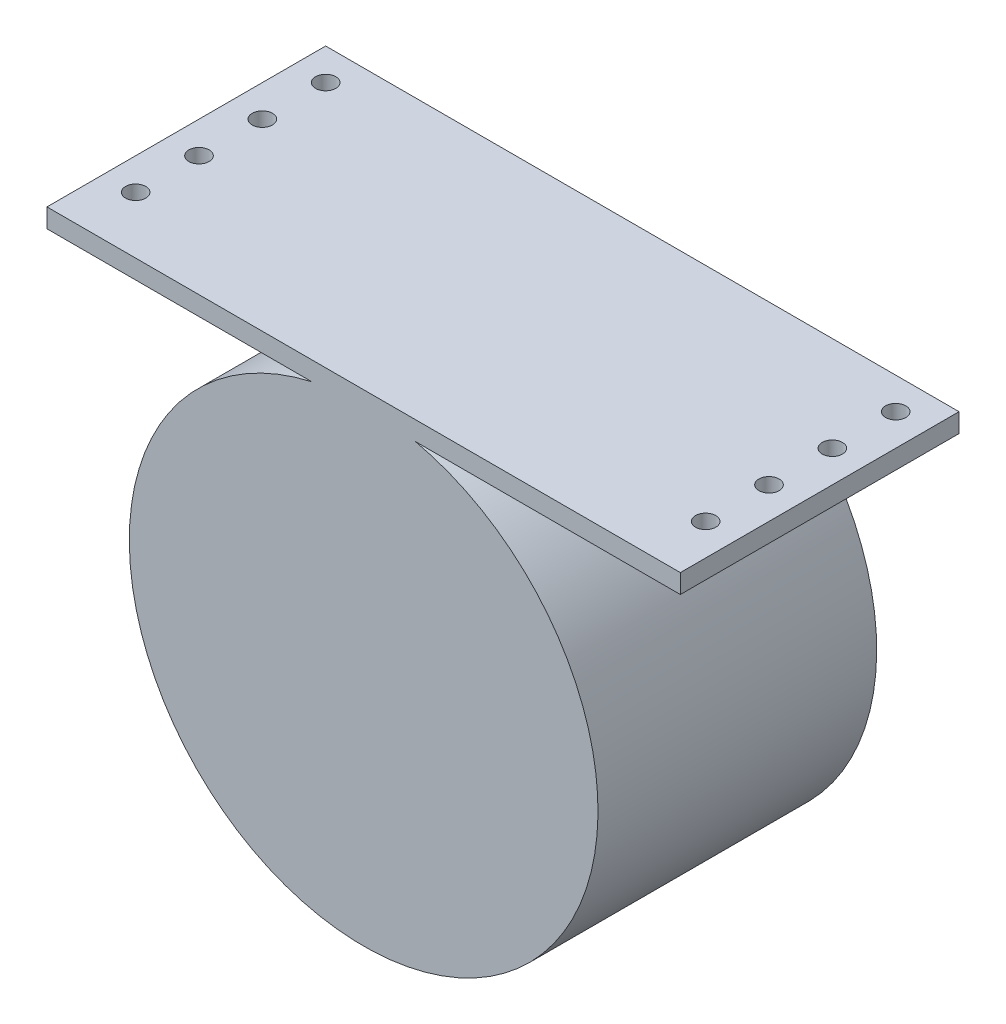
ISO-10303-21;
HEADER;
FILE_DESCRIPTION(('STEP AP214'),'2;1');
FILE_NAME('part.step','',(''),(''),'','','');
FILE_SCHEMA(('AUTOMOTIVE_DESIGN { 1 0 10303 214 1 1 1 1 }'));
ENDSEC;
DATA;
#1=APPLICATION_CONTEXT('core data for automotive mechanical design processes');
#2=APPLICATION_PROTOCOL_DEFINITION('international standard','automotive_design',2000,#1);
#3=PRODUCT_CONTEXT('',#1,'mechanical');
#4=PRODUCT('Part','Part','',(#3));
#5=PRODUCT_RELATED_PRODUCT_CATEGORY('part','',(#4));
#6=PRODUCT_DEFINITION_FORMATION('','',#4);
#7=PRODUCT_DEFINITION_CONTEXT('part definition',#1,'design');
#8=PRODUCT_DEFINITION('design','',#6,#7);
#9=PRODUCT_DEFINITION_SHAPE('','',#8);
#10=(LENGTH_UNIT() NAMED_UNIT(*) SI_UNIT(.MILLI.,.METRE.));
#11=(NAMED_UNIT(*) PLANE_ANGLE_UNIT() SI_UNIT($,.RADIAN.));
#12=(NAMED_UNIT(*) SI_UNIT($,.STERADIAN.) SOLID_ANGLE_UNIT());
#13=UNCERTAINTY_MEASURE_WITH_UNIT(LENGTH_MEASURE(1.E-05),#10,'distance_accuracy_value','');
#14=(GEOMETRIC_REPRESENTATION_CONTEXT(3) GLOBAL_UNCERTAINTY_ASSIGNED_CONTEXT((#13)) GLOBAL_UNIT_ASSIGNED_CONTEXT((#10,
#11,#12)) REPRESENTATION_CONTEXT('',''));
#15=CARTESIAN_POINT('',(0.,0.,0.));
#16=DIRECTION('',(0.,0.,1.));
#17=DIRECTION('',(1.,0.,0.));
#18=AXIS2_PLACEMENT_3D('',#15,#16,#17);
#19=CARTESIAN_POINT('',(-5.79533911298797,4.18541454246696,0.));
#20=DIRECTION('',(0.,0.,1.));
#21=DIRECTION('',(1.,0.,0.));
#22=AXIS2_PLACEMENT_3D('',#19,#20,#21);
#23=PLANE('',#22);
#24=CARTESIAN_POINT('',(-5.79533911298797,4.18541454246696,0.));
#25=DIRECTION('',(0.,0.,-1.));
#26=DIRECTION('',(-1.,0.,0.));
#27=AXIS2_PLACEMENT_3D('',#24,#25,#26);
#28=CIRCLE('',#27,34.);
#29=CARTESIAN_POINT('',(-39.795339112988,4.18541454246696,0.));
#30=VERTEX_POINT('',#29);
#31=EDGE_CURVE('E152',#30,#30,#28,.T.);
#32=ORIENTED_EDGE('',*,*,#31,.F.);
#33=EDGE_LOOP('',(#32));
#34=FACE_BOUND('',#33,.T.);
#35=CARTESIAN_POINT('',(-5.79533911298797,4.18541454246696,0.));
#36=DIRECTION('',(0.,0.,1.));
#37=DIRECTION('',(1.,0.,0.));
#38=AXIS2_PLACEMENT_3D('',#35,#36,#37);
#39=CIRCLE('',#38,37.);
#40=CARTESIAN_POINT('',(-13.9678124205024,40.2715708913768,0.));
#41=VERTEX_POINT('',#40);
#42=CARTESIAN_POINT('',(2.37713419452647,40.2715708913768,0.));
#43=VERTEX_POINT('',#42);
#44=EDGE_CURVE('E110',#41,#43,#39,.T.);
#45=ORIENTED_EDGE('',*,*,#44,.F.);
#46=DIRECTION('',(1.,0.,0.));
#47=VECTOR('',#46,1.);
#48=CARTESIAN_POINT('',(-55.795339112988,40.2715708913768,0.));
#49=LINE('',#48,#47);
#50=CARTESIAN_POINT('',(-55.795339112988,40.2715708913768,0.));
#51=VERTEX_POINT('',#50);
#52=EDGE_CURVE('E123',#51,#41,#49,.T.);
#53=ORIENTED_EDGE('',*,*,#52,.F.);
#54=DIRECTION('',(0.,1.,0.));
#55=VECTOR('',#54,1.);
#56=CARTESIAN_POINT('',(-55.795339112988,40.2715708913768,0.));
#57=LINE('',#56,#55);
#58=CARTESIAN_POINT('',(-55.795339112988,43.2715708913768,0.));
#59=VERTEX_POINT('',#58);
#60=EDGE_CURVE('E104',#51,#59,#57,.T.);
#61=ORIENTED_EDGE('',*,*,#60,.T.);
#62=DIRECTION('',(1.,0.,0.));
#63=VECTOR('',#62,1.);
#64=CARTESIAN_POINT('',(-55.795339112988,43.2715708913768,0.));
#65=LINE('',#64,#63);
#66=CARTESIAN_POINT('',(44.204660887012,43.2715708913768,0.));
#67=VERTEX_POINT('',#66);
#68=EDGE_CURVE('E113',#59,#67,#65,.T.);
#69=ORIENTED_EDGE('',*,*,#68,.T.);
#70=DIRECTION('',(0.,1.,0.));
#71=VECTOR('',#70,1.);
#72=CARTESIAN_POINT('',(44.204660887012,40.2715708913768,0.));
#73=LINE('',#72,#71);
#74=CARTESIAN_POINT('',(44.204660887012,40.2715708913768,0.));
#75=VERTEX_POINT('',#74);
#76=EDGE_CURVE('E119',#75,#67,#73,.T.);
#77=ORIENTED_EDGE('',*,*,#76,.F.);
#78=EDGE_CURVE('E128',#43,#75,#49,.T.);
#79=ORIENTED_EDGE('',*,*,#78,.F.);
#80=EDGE_LOOP('',(#45,#53,#61,#69,#77,#79));
#81=FACE_BOUND('',#80,.T.);
#82=ADVANCED_FACE('F49',(#34,#81),#23,.F.);
#83=CARTESIAN_POINT('',(-5.79533911298797,4.18541454246696,44.));
#84=DIRECTION('',(0.,0.,1.));
#85=DIRECTION('',(1.,0.,0.));
#86=AXIS2_PLACEMENT_3D('',#83,#84,#85);
#87=PLANE('',#86);
#88=CARTESIAN_POINT('',(-5.79533911298797,4.18541454246696,44.));
#89=DIRECTION('',(0.,0.,1.));
#90=DIRECTION('',(1.,0.,0.));
#91=AXIS2_PLACEMENT_3D('',#88,#89,#90);
#92=CIRCLE('',#91,37.);
#93=CARTESIAN_POINT('',(-13.9678124205024,40.2715708913768,44.));
#94=VERTEX_POINT('',#93);
#95=CARTESIAN_POINT('',(2.37713419452647,40.2715708913768,44.));
#96=VERTEX_POINT('',#95);
#97=EDGE_CURVE('E137',#94,#96,#92,.T.);
#98=ORIENTED_EDGE('',*,*,#97,.T.);
#99=DIRECTION('',(1.,0.,0.));
#100=VECTOR('',#99,1.);
#101=CARTESIAN_POINT('',(-55.795339112988,40.2715708913768,44.));
#102=LINE('',#101,#100);
#103=CARTESIAN_POINT('',(44.204660887012,40.2715708913768,44.));
#104=VERTEX_POINT('',#103);
#105=EDGE_CURVE('E186',#96,#104,#102,.T.);
#106=ORIENTED_EDGE('',*,*,#105,.T.);
#107=DIRECTION('',(0.,1.,0.));
#108=VECTOR('',#107,1.);
#109=CARTESIAN_POINT('',(44.204660887012,40.2715708913768,44.));
#110=LINE('',#109,#108);
#111=CARTESIAN_POINT('',(44.204660887012,43.2715708913768,44.));
#112=VERTEX_POINT('',#111);
#113=EDGE_CURVE('E126',#104,#112,#110,.T.);
#114=ORIENTED_EDGE('',*,*,#113,.T.);
#115=DIRECTION('',(1.,0.,0.));
#116=VECTOR('',#115,1.);
#117=CARTESIAN_POINT('',(-55.795339112988,43.2715708913768,44.));
#118=LINE('',#117,#116);
#119=CARTESIAN_POINT('',(-55.795339112988,43.2715708913768,44.));
#120=VERTEX_POINT('',#119);
#121=EDGE_CURVE('E124',#120,#112,#118,.T.);
#122=ORIENTED_EDGE('',*,*,#121,.F.);
#123=DIRECTION('',(0.,1.,0.));
#124=VECTOR('',#123,1.);
#125=CARTESIAN_POINT('',(-55.795339112988,40.2715708913768,44.));
#126=LINE('',#125,#124);
#127=CARTESIAN_POINT('',(-55.795339112988,40.2715708913768,44.));
#128=VERTEX_POINT('',#127);
#129=EDGE_CURVE('E106',#128,#120,#126,.T.);
#130=ORIENTED_EDGE('',*,*,#129,.F.);
#131=EDGE_CURVE('E187',#128,#94,#102,.T.);
#132=ORIENTED_EDGE('',*,*,#131,.T.);
#133=EDGE_LOOP('',(#98,#106,#114,#122,#130,#132));
#134=FACE_BOUND('',#133,.T.);
#135=ADVANCED_FACE('F198',(#134),#87,.T.);
#136=CARTESIAN_POINT('',(-5.79533911298797,4.18541454246696,44.));
#137=DIRECTION('',(0.,0.,-1.));
#138=DIRECTION('',(-1.,0.,0.));
#139=AXIS2_PLACEMENT_3D('',#136,#137,#138);
#140=CYLINDRICAL_SURFACE('',#139,37.);
#141=DIRECTION('',(0.,0.,-1.));
#142=VECTOR('',#141,1.);
#143=CARTESIAN_POINT('',(2.37713419452647,40.2715708913768,44.));
#144=LINE('',#143,#142);
#145=EDGE_CURVE('E12',#96,#43,#144,.T.);
#146=ORIENTED_EDGE('',*,*,#145,.F.);
#147=ORIENTED_EDGE('',*,*,#97,.F.);
#148=DIRECTION('',(0.,0.,-1.));
#149=VECTOR('',#148,1.);
#150=CARTESIAN_POINT('',(-13.9678124205024,40.2715708913768,44.));
#151=LINE('',#150,#149);
#152=EDGE_CURVE('E59',#41,#94,#151,.F.);
#153=ORIENTED_EDGE('',*,*,#152,.F.);
#154=ORIENTED_EDGE('',*,*,#44,.T.);
#155=EDGE_LOOP('',(#146,#147,#153,#154));
#156=FACE_BOUND('',#155,.T.);
#157=ADVANCED_FACE('F201',(#156),#140,.T.);
#158=CARTESIAN_POINT('',(44.204660887012,40.2715708913768,44.));
#159=DIRECTION('',(-1.,0.,0.));
#160=DIRECTION('',(0.,0.,1.));
#161=AXIS2_PLACEMENT_3D('',#158,#159,#160);
#162=PLANE('',#161);
#163=ORIENTED_EDGE('',*,*,#76,.T.);
#164=DIRECTION('',(0.,0.,-1.));
#165=VECTOR('',#164,1.);
#166=CARTESIAN_POINT('',(44.204660887012,43.2715708913768,44.));
#167=LINE('',#166,#165);
#168=EDGE_CURVE('E115',#112,#67,#167,.T.);
#169=ORIENTED_EDGE('',*,*,#168,.F.);
#170=ORIENTED_EDGE('',*,*,#113,.F.);
#171=DIRECTION('',(0.,0.,-1.));
#172=VECTOR('',#171,1.);
#173=CARTESIAN_POINT('',(44.204660887012,40.2715708913768,44.));
#174=LINE('',#173,#172);
#175=EDGE_CURVE('E133',#104,#75,#174,.T.);
#176=ORIENTED_EDGE('',*,*,#175,.T.);
#177=EDGE_LOOP('',(#163,#169,#170,#176));
#178=FACE_BOUND('',#177,.T.);
#179=ADVANCED_FACE('F196',(#178),#162,.F.);
#180=CARTESIAN_POINT('',(-55.795339112988,43.2715708913768,44.));
#181=DIRECTION('',(0.,1.,0.));
#182=DIRECTION('',(0.,0.,1.));
#183=AXIS2_PLACEMENT_3D('',#180,#181,#182);
#184=PLANE('',#183);
#185=CARTESIAN_POINT('',(39.204660887012,43.2715708913768,5.));
#186=DIRECTION('',(0.,1.,0.));
#187=DIRECTION('',(0.,0.,1.));
#188=AXIS2_PLACEMENT_3D('',#185,#186,#187);
#189=CIRCLE('',#188,1.6);
#190=CARTESIAN_POINT('',(39.204660887012,43.2715708913768,6.6));
#191=VERTEX_POINT('',#190);
#192=EDGE_CURVE('E157',#191,#191,#189,.T.);
#193=ORIENTED_EDGE('',*,*,#192,.F.);
#194=EDGE_LOOP('',(#193));
#195=FACE_BOUND('',#194,.T.);
#196=CARTESIAN_POINT('',(39.204660887012,43.2715708913768,15.));
#197=DIRECTION('',(0.,1.,0.));
#198=DIRECTION('',(0.,0.,1.));
#199=AXIS2_PLACEMENT_3D('',#196,#197,#198);
#200=CIRCLE('',#199,1.6);
#201=CARTESIAN_POINT('',(39.204660887012,43.2715708913768,16.6));
#202=VERTEX_POINT('',#201);
#203=EDGE_CURVE('E278',#202,#202,#200,.T.);
#204=ORIENTED_EDGE('',*,*,#203,.F.);
#205=EDGE_LOOP('',(#204));
#206=FACE_BOUND('',#205,.T.);
#207=CARTESIAN_POINT('',(39.204660887012,43.2715708913768,25.));
#208=DIRECTION('',(0.,1.,0.));
#209=DIRECTION('',(0.,0.,1.));
#210=AXIS2_PLACEMENT_3D('',#207,#208,#209);
#211=CIRCLE('',#210,1.6);
#212=CARTESIAN_POINT('',(39.204660887012,43.2715708913768,26.6));
#213=VERTEX_POINT('',#212);
#214=EDGE_CURVE('E281',#213,#213,#211,.T.);
#215=ORIENTED_EDGE('',*,*,#214,.F.);
#216=EDGE_LOOP('',(#215));
#217=FACE_BOUND('',#216,.T.);
#218=CARTESIAN_POINT('',(39.204660887012,43.2715708913768,35.));
#219=DIRECTION('',(0.,1.,0.));
#220=DIRECTION('',(0.,0.,1.));
#221=AXIS2_PLACEMENT_3D('',#218,#219,#220);
#222=CIRCLE('',#221,1.6);
#223=CARTESIAN_POINT('',(39.204660887012,43.2715708913768,36.6));
#224=VERTEX_POINT('',#223);
#225=EDGE_CURVE('E286',#224,#224,#222,.T.);
#226=ORIENTED_EDGE('',*,*,#225,.F.);
#227=EDGE_LOOP('',(#226));
#228=FACE_BOUND('',#227,.T.);
#229=CARTESIAN_POINT('',(-50.795339112988,43.2715708913768,5.));
#230=DIRECTION('',(0.,1.,0.));
#231=DIRECTION('',(0.,0.,1.));
#232=AXIS2_PLACEMENT_3D('',#229,#230,#231);
#233=CIRCLE('',#232,1.6);
#234=CARTESIAN_POINT('',(-50.795339112988,43.2715708913768,6.6));
#235=VERTEX_POINT('',#234);
#236=EDGE_CURVE('E143',#235,#235,#233,.T.);
#237=ORIENTED_EDGE('',*,*,#236,.F.);
#238=EDGE_LOOP('',(#237));
#239=FACE_BOUND('',#238,.T.);
#240=CARTESIAN_POINT('',(-50.795339112988,43.2715708913768,15.));
#241=DIRECTION('',(0.,1.,0.));
#242=DIRECTION('',(0.,0.,1.));
#243=AXIS2_PLACEMENT_3D('',#240,#241,#242);
#244=CIRCLE('',#243,1.6);
#245=CARTESIAN_POINT('',(-50.795339112988,43.2715708913768,16.6));
#246=VERTEX_POINT('',#245);
#247=EDGE_CURVE('E173',#246,#246,#244,.T.);
#248=ORIENTED_EDGE('',*,*,#247,.F.);
#249=EDGE_LOOP('',(#248));
#250=FACE_BOUND('',#249,.T.);
#251=CARTESIAN_POINT('',(-50.795339112988,43.2715708913768,25.));
#252=DIRECTION('',(0.,1.,0.));
#253=DIRECTION('',(0.,0.,1.));
#254=AXIS2_PLACEMENT_3D('',#251,#252,#253);
#255=CIRCLE('',#254,1.6);
#256=CARTESIAN_POINT('',(-50.795339112988,43.2715708913768,26.6));
#257=VERTEX_POINT('',#256);
#258=EDGE_CURVE('E168',#257,#257,#255,.T.);
#259=ORIENTED_EDGE('',*,*,#258,.F.);
#260=EDGE_LOOP('',(#259));
#261=FACE_BOUND('',#260,.T.);
#262=CARTESIAN_POINT('',(-50.795339112988,43.2715708913768,35.));
#263=DIRECTION('',(0.,1.,0.));
#264=DIRECTION('',(0.,0.,1.));
#265=AXIS2_PLACEMENT_3D('',#262,#263,#264);
#266=CIRCLE('',#265,1.6);
#267=CARTESIAN_POINT('',(-50.795339112988,43.2715708913768,36.6));
#268=VERTEX_POINT('',#267);
#269=EDGE_CURVE('E164',#268,#268,#266,.T.);
#270=ORIENTED_EDGE('',*,*,#269,.F.);
#271=EDGE_LOOP('',(#270));
#272=FACE_BOUND('',#271,.T.);
#273=ORIENTED_EDGE('',*,*,#68,.F.);
#274=DIRECTION('',(0.,0.,-1.));
#275=VECTOR('',#274,1.);
#276=CARTESIAN_POINT('',(-55.795339112988,43.2715708913768,44.));
#277=LINE('',#276,#275);
#278=EDGE_CURVE('E100',#120,#59,#277,.T.);
#279=ORIENTED_EDGE('',*,*,#278,.F.);
#280=ORIENTED_EDGE('',*,*,#121,.T.);
#281=ORIENTED_EDGE('',*,*,#168,.T.);
#282=EDGE_LOOP('',(#273,#279,#280,#281));
#283=FACE_BOUND('',#282,.T.);
#284=ADVANCED_FACE('F51',(#195,#206,#217,#228,#239,#250,#261,#272,#283),#184,.T.);
#285=CARTESIAN_POINT('',(-55.795339112988,40.2715708913768,44.));
#286=DIRECTION('',(-1.,0.,0.));
#287=DIRECTION('',(0.,0.,1.));
#288=AXIS2_PLACEMENT_3D('',#285,#286,#287);
#289=PLANE('',#288);
#290=ORIENTED_EDGE('',*,*,#60,.F.);
#291=DIRECTION('',(0.,0.,-1.));
#292=VECTOR('',#291,1.);
#293=CARTESIAN_POINT('',(-55.795339112988,40.2715708913768,44.));
#294=LINE('',#293,#292);
#295=EDGE_CURVE('E94',#128,#51,#294,.T.);
#296=ORIENTED_EDGE('',*,*,#295,.F.);
#297=ORIENTED_EDGE('',*,*,#129,.T.);
#298=ORIENTED_EDGE('',*,*,#278,.T.);
#299=EDGE_LOOP('',(#290,#296,#297,#298));
#300=FACE_BOUND('',#299,.T.);
#301=ADVANCED_FACE('F102',(#300),#289,.T.);
#302=CARTESIAN_POINT('',(-55.795339112988,40.2715708913768,44.));
#303=DIRECTION('',(0.,1.,0.));
#304=DIRECTION('',(0.,0.,1.));
#305=AXIS2_PLACEMENT_3D('',#302,#303,#304);
#306=PLANE('',#305);
#307=CARTESIAN_POINT('',(-50.795339112988,40.2715708913768,5.));
#308=DIRECTION('',(0.,1.,0.));
#309=DIRECTION('',(0.,0.,1.));
#310=AXIS2_PLACEMENT_3D('',#307,#308,#309);
#311=CIRCLE('',#310,1.6);
#312=CARTESIAN_POINT('',(-50.795339112988,40.2715708913768,6.6));
#313=VERTEX_POINT('',#312);
#314=EDGE_CURVE('E149',#313,#313,#311,.T.);
#315=ORIENTED_EDGE('',*,*,#314,.T.);
#316=EDGE_LOOP('',(#315));
#317=FACE_BOUND('',#316,.T.);
#318=CARTESIAN_POINT('',(-50.795339112988,40.2715708913768,15.));
#319=DIRECTION('',(0.,1.,0.));
#320=DIRECTION('',(0.,0.,1.));
#321=AXIS2_PLACEMENT_3D('',#318,#319,#320);
#322=CIRCLE('',#321,1.6);
#323=CARTESIAN_POINT('',(-50.795339112988,40.2715708913768,16.6));
#324=VERTEX_POINT('',#323);
#325=EDGE_CURVE('E146',#324,#324,#322,.T.);
#326=ORIENTED_EDGE('',*,*,#325,.T.);
#327=EDGE_LOOP('',(#326));
#328=FACE_BOUND('',#327,.T.);
#329=CARTESIAN_POINT('',(-50.795339112988,40.2715708913768,25.));
#330=DIRECTION('',(0.,1.,0.));
#331=DIRECTION('',(0.,0.,1.));
#332=AXIS2_PLACEMENT_3D('',#329,#330,#331);
#333=CIRCLE('',#332,1.6);
#334=CARTESIAN_POINT('',(-50.795339112988,40.2715708913768,26.6));
#335=VERTEX_POINT('',#334);
#336=EDGE_CURVE('E142',#335,#335,#333,.T.);
#337=ORIENTED_EDGE('',*,*,#336,.T.);
#338=EDGE_LOOP('',(#337));
#339=FACE_BOUND('',#338,.T.);
#340=CARTESIAN_POINT('',(-50.795339112988,40.2715708913768,35.));
#341=DIRECTION('',(0.,1.,0.));
#342=DIRECTION('',(0.,0.,1.));
#343=AXIS2_PLACEMENT_3D('',#340,#341,#342);
#344=CIRCLE('',#343,1.6);
#345=CARTESIAN_POINT('',(-50.795339112988,40.2715708913768,36.6));
#346=VERTEX_POINT('',#345);
#347=EDGE_CURVE('E139',#346,#346,#344,.T.);
#348=ORIENTED_EDGE('',*,*,#347,.T.);
#349=EDGE_LOOP('',(#348));
#350=FACE_BOUND('',#349,.T.);
#351=ORIENTED_EDGE('',*,*,#52,.T.);
#352=ORIENTED_EDGE('',*,*,#152,.T.);
#353=ORIENTED_EDGE('',*,*,#131,.F.);
#354=ORIENTED_EDGE('',*,*,#295,.T.);
#355=EDGE_LOOP('',(#351,#352,#353,#354));
#356=FACE_BOUND('',#355,.T.);
#357=ADVANCED_FACE('F203',(#317,#328,#339,#350,#356),#306,.F.);
#358=CARTESIAN_POINT('',(39.204660887012,40.2715708913768,5.));
#359=DIRECTION('',(0.,1.,0.));
#360=DIRECTION('',(0.,0.,1.));
#361=AXIS2_PLACEMENT_3D('',#358,#359,#360);
#362=CIRCLE('',#361,1.6);
#363=CARTESIAN_POINT('',(39.204660887012,40.2715708913768,6.6));
#364=VERTEX_POINT('',#363);
#365=EDGE_CURVE('E53',#364,#364,#362,.T.);
#366=ORIENTED_EDGE('',*,*,#365,.T.);
#367=EDGE_LOOP('',(#366));
#368=FACE_BOUND('',#367,.T.);
#369=CARTESIAN_POINT('',(39.204660887012,40.2715708913768,15.));
#370=DIRECTION('',(0.,1.,0.));
#371=DIRECTION('',(0.,0.,1.));
#372=AXIS2_PLACEMENT_3D('',#369,#370,#371);
#373=CIRCLE('',#372,1.6);
#374=CARTESIAN_POINT('',(39.204660887012,40.2715708913768,16.6));
#375=VERTEX_POINT('',#374);
#376=EDGE_CURVE('E159',#375,#375,#373,.T.);
#377=ORIENTED_EDGE('',*,*,#376,.T.);
#378=EDGE_LOOP('',(#377));
#379=FACE_BOUND('',#378,.T.);
#380=CARTESIAN_POINT('',(39.204660887012,40.2715708913768,25.));
#381=DIRECTION('',(0.,1.,0.));
#382=DIRECTION('',(0.,0.,1.));
#383=AXIS2_PLACEMENT_3D('',#380,#381,#382);
#384=CIRCLE('',#383,1.6);
#385=CARTESIAN_POINT('',(39.204660887012,40.2715708913768,26.6));
#386=VERTEX_POINT('',#385);
#387=EDGE_CURVE('E156',#386,#386,#384,.T.);
#388=ORIENTED_EDGE('',*,*,#387,.T.);
#389=EDGE_LOOP('',(#388));
#390=FACE_BOUND('',#389,.T.);
#391=CARTESIAN_POINT('',(39.204660887012,40.2715708913768,35.));
#392=DIRECTION('',(0.,1.,0.));
#393=DIRECTION('',(0.,0.,1.));
#394=AXIS2_PLACEMENT_3D('',#391,#392,#393);
#395=CIRCLE('',#394,1.6);
#396=CARTESIAN_POINT('',(39.204660887012,40.2715708913768,36.6));
#397=VERTEX_POINT('',#396);
#398=EDGE_CURVE('E153',#397,#397,#395,.T.);
#399=ORIENTED_EDGE('',*,*,#398,.T.);
#400=EDGE_LOOP('',(#399));
#401=FACE_BOUND('',#400,.T.);
#402=ORIENTED_EDGE('',*,*,#105,.F.);
#403=ORIENTED_EDGE('',*,*,#145,.T.);
#404=ORIENTED_EDGE('',*,*,#78,.T.);
#405=ORIENTED_EDGE('',*,*,#175,.F.);
#406=EDGE_LOOP('',(#402,#403,#404,#405));
#407=FACE_BOUND('',#406,.T.);
#408=ADVANCED_FACE('F194',(#368,#379,#390,#401,#407),#306,.F.);
#409=CARTESIAN_POINT('',(-5.79533911298797,4.18541454246696,40.));
#410=DIRECTION('',(0.,0.,-1.));
#411=DIRECTION('',(-1.,0.,0.));
#412=AXIS2_PLACEMENT_3D('',#409,#410,#411);
#413=CYLINDRICAL_SURFACE('',#412,34.);
#414=CARTESIAN_POINT('',(-5.79533911298797,4.18541454246696,40.));
#415=DIRECTION('',(0.,0.,-1.));
#416=DIRECTION('',(-1.,0.,0.));
#417=AXIS2_PLACEMENT_3D('',#414,#415,#416);
#418=CIRCLE('',#417,34.);
#419=CARTESIAN_POINT('',(-39.795339112988,4.18541454246696,40.));
#420=VERTEX_POINT('',#419);
#421=EDGE_CURVE('E120',#420,#420,#418,.T.);
#422=ORIENTED_EDGE('',*,*,#421,.F.);
#423=EDGE_LOOP('',(#422));
#424=FACE_BOUND('',#423,.T.);
#425=ORIENTED_EDGE('',*,*,#31,.T.);
#426=EDGE_LOOP('',(#425));
#427=FACE_BOUND('',#426,.T.);
#428=ADVANCED_FACE('F211',(#424,#427),#413,.F.);
#429=CARTESIAN_POINT('',(-5.79533911298797,4.18541454246696,40.));
#430=DIRECTION('',(0.,0.,-1.));
#431=DIRECTION('',(-1.,0.,0.));
#432=AXIS2_PLACEMENT_3D('',#429,#430,#431);
#433=PLANE('',#432);
#434=ORIENTED_EDGE('',*,*,#421,.T.);
#435=EDGE_LOOP('',(#434));
#436=FACE_BOUND('',#435,.T.);
#437=ADVANCED_FACE('F232',(#436),#433,.T.);
#438=CARTESIAN_POINT('',(-50.795339112988,33.2715708913768,35.));
#439=DIRECTION('',(0.,1.,0.));
#440=DIRECTION('',(0.,0.,1.));
#441=AXIS2_PLACEMENT_3D('',#438,#439,#440);
#442=CYLINDRICAL_SURFACE('',#441,1.6);
#443=ORIENTED_EDGE('',*,*,#269,.T.);
#444=EDGE_LOOP('',(#443));
#445=FACE_BOUND('',#444,.T.);
#446=ORIENTED_EDGE('',*,*,#347,.F.);
#447=EDGE_LOOP('',(#446));
#448=FACE_BOUND('',#447,.T.);
#449=ADVANCED_FACE('F238',(#445,#448),#442,.F.);
#450=CARTESIAN_POINT('',(-50.795339112988,33.2715708913768,25.));
#451=DIRECTION('',(0.,1.,0.));
#452=DIRECTION('',(0.,0.,1.));
#453=AXIS2_PLACEMENT_3D('',#450,#451,#452);
#454=CYLINDRICAL_SURFACE('',#453,1.6);
#455=ORIENTED_EDGE('',*,*,#258,.T.);
#456=EDGE_LOOP('',(#455));
#457=FACE_BOUND('',#456,.T.);
#458=ORIENTED_EDGE('',*,*,#336,.F.);
#459=EDGE_LOOP('',(#458));
#460=FACE_BOUND('',#459,.T.);
#461=ADVANCED_FACE('F246',(#457,#460),#454,.F.);
#462=CARTESIAN_POINT('',(-50.795339112988,33.2715708913768,15.));
#463=DIRECTION('',(0.,1.,0.));
#464=DIRECTION('',(0.,0.,1.));
#465=AXIS2_PLACEMENT_3D('',#462,#463,#464);
#466=CYLINDRICAL_SURFACE('',#465,1.6);
#467=ORIENTED_EDGE('',*,*,#247,.T.);
#468=EDGE_LOOP('',(#467));
#469=FACE_BOUND('',#468,.T.);
#470=ORIENTED_EDGE('',*,*,#325,.F.);
#471=EDGE_LOOP('',(#470));
#472=FACE_BOUND('',#471,.T.);
#473=ADVANCED_FACE('F249',(#469,#472),#466,.F.);
#474=CARTESIAN_POINT('',(-50.795339112988,33.2715708913768,5.));
#475=DIRECTION('',(0.,1.,0.));
#476=DIRECTION('',(0.,0.,1.));
#477=AXIS2_PLACEMENT_3D('',#474,#475,#476);
#478=CYLINDRICAL_SURFACE('',#477,1.6);
#479=ORIENTED_EDGE('',*,*,#236,.T.);
#480=EDGE_LOOP('',(#479));
#481=FACE_BOUND('',#480,.T.);
#482=ORIENTED_EDGE('',*,*,#314,.F.);
#483=EDGE_LOOP('',(#482));
#484=FACE_BOUND('',#483,.T.);
#485=ADVANCED_FACE('F253',(#481,#484),#478,.F.);
#486=CARTESIAN_POINT('',(39.204660887012,33.2715708913768,35.));
#487=DIRECTION('',(0.,1.,0.));
#488=DIRECTION('',(0.,0.,1.));
#489=AXIS2_PLACEMENT_3D('',#486,#487,#488);
#490=CYLINDRICAL_SURFACE('',#489,1.6);
#491=ORIENTED_EDGE('',*,*,#225,.T.);
#492=EDGE_LOOP('',(#491));
#493=FACE_BOUND('',#492,.T.);
#494=ORIENTED_EDGE('',*,*,#398,.F.);
#495=EDGE_LOOP('',(#494));
#496=FACE_BOUND('',#495,.T.);
#497=ADVANCED_FACE('F257',(#493,#496),#490,.F.);
#498=CARTESIAN_POINT('',(39.204660887012,33.2715708913768,25.));
#499=DIRECTION('',(0.,1.,0.));
#500=DIRECTION('',(0.,0.,1.));
#501=AXIS2_PLACEMENT_3D('',#498,#499,#500);
#502=CYLINDRICAL_SURFACE('',#501,1.6);
#503=ORIENTED_EDGE('',*,*,#214,.T.);
#504=EDGE_LOOP('',(#503));
#505=FACE_BOUND('',#504,.T.);
#506=ORIENTED_EDGE('',*,*,#387,.F.);
#507=EDGE_LOOP('',(#506));
#508=FACE_BOUND('',#507,.T.);
#509=ADVANCED_FACE('F261',(#505,#508),#502,.F.);
#510=CARTESIAN_POINT('',(39.204660887012,33.2715708913768,15.));
#511=DIRECTION('',(0.,1.,0.));
#512=DIRECTION('',(0.,0.,1.));
#513=AXIS2_PLACEMENT_3D('',#510,#511,#512);
#514=CYLINDRICAL_SURFACE('',#513,1.6);
#515=ORIENTED_EDGE('',*,*,#203,.T.);
#516=EDGE_LOOP('',(#515));
#517=FACE_BOUND('',#516,.T.);
#518=ORIENTED_EDGE('',*,*,#376,.F.);
#519=EDGE_LOOP('',(#518));
#520=FACE_BOUND('',#519,.T.);
#521=ADVANCED_FACE('F265',(#517,#520),#514,.F.);
#522=CARTESIAN_POINT('',(39.204660887012,33.2715708913768,5.));
#523=DIRECTION('',(0.,1.,0.));
#524=DIRECTION('',(0.,0.,1.));
#525=AXIS2_PLACEMENT_3D('',#522,#523,#524);
#526=CYLINDRICAL_SURFACE('',#525,1.6);
#527=ORIENTED_EDGE('',*,*,#192,.T.);
#528=EDGE_LOOP('',(#527));
#529=FACE_BOUND('',#528,.T.);
#530=ORIENTED_EDGE('',*,*,#365,.F.);
#531=EDGE_LOOP('',(#530));
#532=FACE_BOUND('',#531,.T.);
#533=ADVANCED_FACE('F269',(#529,#532),#526,.F.);
#534=CLOSED_SHELL('',(#82,#135,#157,#179,#284,#301,#357,#408,#428,#437,#449,#461,#473,#485,#497,
#509,#521,#533));
#535=MANIFOLD_SOLID_BREP('B2',#534);
#536=ADVANCED_BREP_SHAPE_REPRESENTATION('',(#18,#535),#14);
#537=SHAPE_DEFINITION_REPRESENTATION(#9,#536);
ENDSEC;
END-ISO-10303-21;
